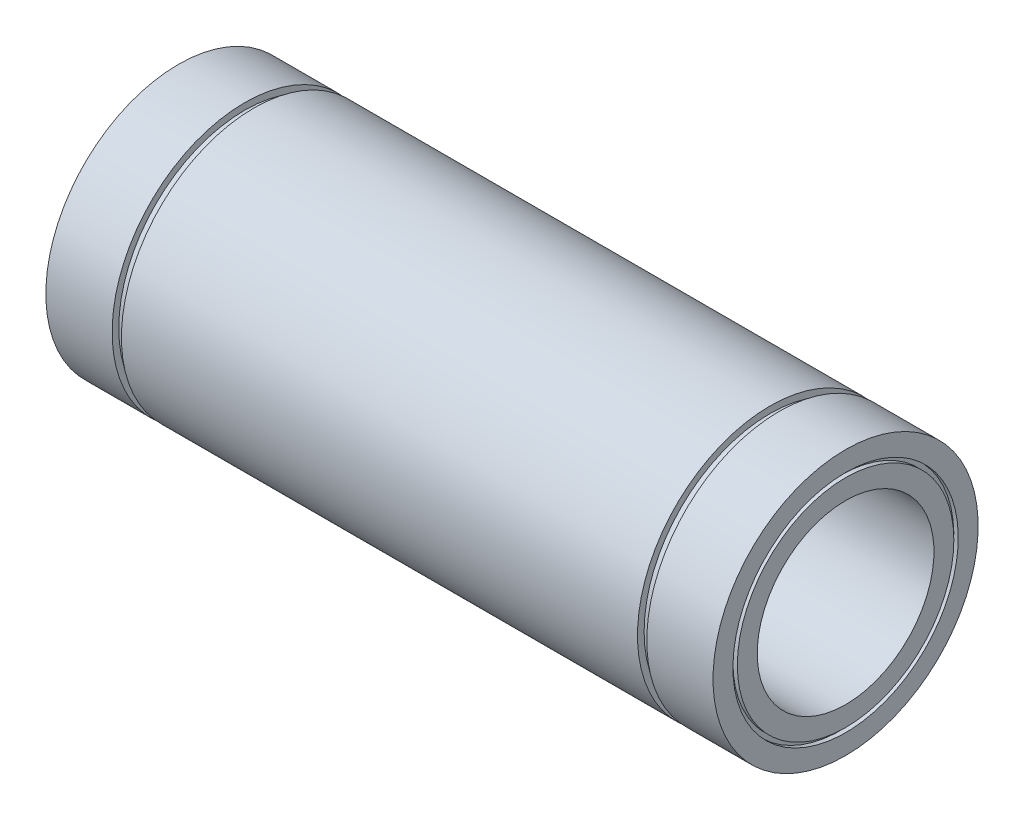
ISO-10303-21;
HEADER;
FILE_DESCRIPTION(('STEP AP214'),'2;1');
FILE_NAME('part.step','',(''),(''),'','','');
FILE_SCHEMA(('AUTOMOTIVE_DESIGN { 1 0 10303 214 1 1 1 1 }'));
ENDSEC;
DATA;
#1=APPLICATION_CONTEXT('core data for automotive mechanical design processes');
#2=APPLICATION_PROTOCOL_DEFINITION('international standard','automotive_design',2000,#1);
#3=PRODUCT_CONTEXT('',#1,'mechanical');
#4=PRODUCT('Part','Part','',(#3));
#5=PRODUCT_RELATED_PRODUCT_CATEGORY('part','',(#4));
#6=PRODUCT_DEFINITION_FORMATION('','',#4);
#7=PRODUCT_DEFINITION_CONTEXT('part definition',#1,'design');
#8=PRODUCT_DEFINITION('design','',#6,#7);
#9=PRODUCT_DEFINITION_SHAPE('','',#8);
#10=(LENGTH_UNIT() NAMED_UNIT(*) SI_UNIT(.MILLI.,.METRE.));
#11=(NAMED_UNIT(*) PLANE_ANGLE_UNIT() SI_UNIT($,.RADIAN.));
#12=(NAMED_UNIT(*) SI_UNIT($,.STERADIAN.) SOLID_ANGLE_UNIT());
#13=UNCERTAINTY_MEASURE_WITH_UNIT(LENGTH_MEASURE(1.E-05),#10,'distance_accuracy_value','');
#14=(GEOMETRIC_REPRESENTATION_CONTEXT(3) GLOBAL_UNCERTAINTY_ASSIGNED_CONTEXT((#13)) GLOBAL_UNIT_ASSIGNED_CONTEXT((#10,
#11,#12)) REPRESENTATION_CONTEXT('',''));
#15=CARTESIAN_POINT('',(0.,0.,0.));
#16=DIRECTION('',(0.,0.,1.));
#17=DIRECTION('',(1.,0.,0.));
#18=AXIS2_PLACEMENT_3D('',#15,#16,#17);
#19=CARTESIAN_POINT('',(-75.5,25.4999999999999,0.));
#20=DIRECTION('',(-1.,0.,0.));
#21=DIRECTION('',(0.,-1.,0.));
#22=AXIS2_PLACEMENT_3D('',#19,#20,#21);
#23=PLANE('',#22);
#24=CARTESIAN_POINT('',(-75.5,0.,0.));
#25=DIRECTION('',(1.,0.,0.));
#26=DIRECTION('',(0.,1.,0.));
#27=AXIS2_PLACEMENT_3D('',#24,#25,#26);
#28=CIRCLE('',#27,25.5);
#29=CARTESIAN_POINT('',(-75.5,25.4999999999999,0.));
#30=VERTEX_POINT('',#29);
#31=EDGE_CURVE('E123',#30,#30,#28,.T.);
#32=ORIENTED_EDGE('',*,*,#31,.T.);
#33=EDGE_LOOP('',(#32));
#34=FACE_BOUND('',#33,.T.);
#35=CARTESIAN_POINT('',(-75.5,0.,0.));
#36=DIRECTION('',(1.,0.,0.));
#37=DIRECTION('',(0.,1.,0.));
#38=AXIS2_PLACEMENT_3D('',#35,#36,#37);
#39=CIRCLE('',#38,30.);
#40=CARTESIAN_POINT('',(-75.5,29.9999999999999,0.));
#41=VERTEX_POINT('',#40);
#42=EDGE_CURVE('E10',#41,#41,#39,.T.);
#43=ORIENTED_EDGE('',*,*,#42,.F.);
#44=EDGE_LOOP('',(#43));
#45=FACE_BOUND('',#44,.T.);
#46=ADVANCED_FACE('F40',(#34,#45),#23,.T.);
#47=CARTESIAN_POINT('',(0.,0.,0.));
#48=DIRECTION('',(1.,0.,0.));
#49=DIRECTION('',(0.,1.,0.));
#50=AXIS2_PLACEMENT_3D('',#47,#48,#49);
#51=CYLINDRICAL_SURFACE('',#50,30.);
#52=ORIENTED_EDGE('',*,*,#42,.T.);
#53=EDGE_LOOP('',(#52));
#54=FACE_BOUND('',#53,.T.);
#55=CARTESIAN_POINT('',(-60.5,0.,0.));
#56=DIRECTION('',(1.,0.,0.));
#57=DIRECTION('',(0.,1.,0.));
#58=AXIS2_PLACEMENT_3D('',#55,#56,#57);
#59=CIRCLE('',#58,30.);
#60=CARTESIAN_POINT('',(-60.5,29.9999999999999,0.));
#61=VERTEX_POINT('',#60);
#62=EDGE_CURVE('E47',#61,#61,#59,.T.);
#63=ORIENTED_EDGE('',*,*,#62,.F.);
#64=EDGE_LOOP('',(#63));
#65=FACE_BOUND('',#64,.T.);
#66=ADVANCED_FACE('F142',(#54,#65),#51,.T.);
#67=CARTESIAN_POINT('',(-60.5,29.9999999999999,0.));
#68=DIRECTION('',(1.,0.,0.));
#69=DIRECTION('',(0.,1.,0.));
#70=AXIS2_PLACEMENT_3D('',#67,#68,#69);
#71=PLANE('',#70);
#72=ORIENTED_EDGE('',*,*,#62,.T.);
#73=EDGE_LOOP('',(#72));
#74=FACE_BOUND('',#73,.T.);
#75=CARTESIAN_POINT('',(-60.5,0.,0.));
#76=DIRECTION('',(1.,0.,0.));
#77=DIRECTION('',(0.,1.,0.));
#78=AXIS2_PLACEMENT_3D('',#75,#76,#77);
#79=CIRCLE('',#78,28.5);
#80=CARTESIAN_POINT('',(-60.5,28.5,0.));
#81=VERTEX_POINT('',#80);
#82=EDGE_CURVE('E54',#81,#81,#79,.T.);
#83=ORIENTED_EDGE('',*,*,#82,.F.);
#84=EDGE_LOOP('',(#83));
#85=FACE_BOUND('',#84,.T.);
#86=ADVANCED_FACE('F146',(#74,#85),#71,.T.);
#87=CARTESIAN_POINT('',(0.,0.,0.));
#88=DIRECTION('',(1.,0.,0.));
#89=DIRECTION('',(0.,1.,0.));
#90=AXIS2_PLACEMENT_3D('',#87,#88,#89);
#91=CYLINDRICAL_SURFACE('',#90,28.5);
#92=ORIENTED_EDGE('',*,*,#82,.T.);
#93=EDGE_LOOP('',(#92));
#94=FACE_BOUND('',#93,.T.);
#95=CARTESIAN_POINT('',(-58.4,0.,0.));
#96=DIRECTION('',(1.,0.,0.));
#97=DIRECTION('',(0.,1.,0.));
#98=AXIS2_PLACEMENT_3D('',#95,#96,#97);
#99=CIRCLE('',#98,28.5);
#100=CARTESIAN_POINT('',(-58.4,28.5,0.));
#101=VERTEX_POINT('',#100);
#102=EDGE_CURVE('E61',#101,#101,#99,.T.);
#103=ORIENTED_EDGE('',*,*,#102,.F.);
#104=EDGE_LOOP('',(#103));
#105=FACE_BOUND('',#104,.T.);
#106=ADVANCED_FACE('F150',(#94,#105),#91,.T.);
#107=CARTESIAN_POINT('',(-58.4,28.5,0.));
#108=DIRECTION('',(-1.,0.,0.));
#109=DIRECTION('',(0.,-1.,0.));
#110=AXIS2_PLACEMENT_3D('',#107,#108,#109);
#111=PLANE('',#110);
#112=ORIENTED_EDGE('',*,*,#102,.T.);
#113=EDGE_LOOP('',(#112));
#114=FACE_BOUND('',#113,.T.);
#115=CARTESIAN_POINT('',(-58.4,0.,0.));
#116=DIRECTION('',(1.,0.,0.));
#117=DIRECTION('',(0.,1.,0.));
#118=AXIS2_PLACEMENT_3D('',#115,#116,#117);
#119=CIRCLE('',#118,30.);
#120=CARTESIAN_POINT('',(-58.4,29.9999999999999,0.));
#121=VERTEX_POINT('',#120);
#122=EDGE_CURVE('E67',#121,#121,#119,.T.);
#123=ORIENTED_EDGE('',*,*,#122,.F.);
#124=EDGE_LOOP('',(#123));
#125=FACE_BOUND('',#124,.T.);
#126=ADVANCED_FACE('F156',(#114,#125),#111,.T.);
#127=CARTESIAN_POINT('',(0.,0.,0.));
#128=DIRECTION('',(1.,0.,0.));
#129=DIRECTION('',(0.,1.,0.));
#130=AXIS2_PLACEMENT_3D('',#127,#128,#129);
#131=CYLINDRICAL_SURFACE('',#130,30.);
#132=ORIENTED_EDGE('',*,*,#122,.T.);
#133=EDGE_LOOP('',(#132));
#134=FACE_BOUND('',#133,.T.);
#135=CARTESIAN_POINT('',(58.4,0.,0.));
#136=DIRECTION('',(1.,0.,0.));
#137=DIRECTION('',(0.,1.,0.));
#138=AXIS2_PLACEMENT_3D('',#135,#136,#137);
#139=CIRCLE('',#138,30.);
#140=CARTESIAN_POINT('',(58.4,30.,0.));
#141=VERTEX_POINT('',#140);
#142=EDGE_CURVE('E70',#141,#141,#139,.T.);
#143=ORIENTED_EDGE('',*,*,#142,.F.);
#144=EDGE_LOOP('',(#143));
#145=FACE_BOUND('',#144,.T.);
#146=ADVANCED_FACE('F160',(#134,#145),#131,.T.);
#147=CARTESIAN_POINT('',(58.4,30.,0.));
#148=DIRECTION('',(1.,0.,0.));
#149=DIRECTION('',(0.,1.,0.));
#150=AXIS2_PLACEMENT_3D('',#147,#148,#149);
#151=PLANE('',#150);
#152=ORIENTED_EDGE('',*,*,#142,.T.);
#153=EDGE_LOOP('',(#152));
#154=FACE_BOUND('',#153,.T.);
#155=CARTESIAN_POINT('',(58.4,0.,0.));
#156=DIRECTION('',(1.,0.,0.));
#157=DIRECTION('',(0.,1.,0.));
#158=AXIS2_PLACEMENT_3D('',#155,#156,#157);
#159=CIRCLE('',#158,28.5);
#160=CARTESIAN_POINT('',(58.4,28.5,0.));
#161=VERTEX_POINT('',#160);
#162=EDGE_CURVE('E74',#161,#161,#159,.T.);
#163=ORIENTED_EDGE('',*,*,#162,.F.);
#164=EDGE_LOOP('',(#163));
#165=FACE_BOUND('',#164,.T.);
#166=ADVANCED_FACE('F164',(#154,#165),#151,.T.);
#167=CARTESIAN_POINT('',(0.,0.,0.));
#168=DIRECTION('',(1.,0.,0.));
#169=DIRECTION('',(0.,1.,0.));
#170=AXIS2_PLACEMENT_3D('',#167,#168,#169);
#171=CYLINDRICAL_SURFACE('',#170,28.5);
#172=ORIENTED_EDGE('',*,*,#162,.T.);
#173=EDGE_LOOP('',(#172));
#174=FACE_BOUND('',#173,.T.);
#175=CARTESIAN_POINT('',(60.5,0.,0.));
#176=DIRECTION('',(1.,0.,0.));
#177=DIRECTION('',(0.,1.,0.));
#178=AXIS2_PLACEMENT_3D('',#175,#176,#177);
#179=CIRCLE('',#178,28.5);
#180=CARTESIAN_POINT('',(60.5,28.5,0.));
#181=VERTEX_POINT('',#180);
#182=EDGE_CURVE('E78',#181,#181,#179,.T.);
#183=ORIENTED_EDGE('',*,*,#182,.F.);
#184=EDGE_LOOP('',(#183));
#185=FACE_BOUND('',#184,.T.);
#186=ADVANCED_FACE('F168',(#174,#185),#171,.T.);
#187=CARTESIAN_POINT('',(60.5,28.5,0.));
#188=DIRECTION('',(-1.,0.,0.));
#189=DIRECTION('',(0.,-1.,0.));
#190=AXIS2_PLACEMENT_3D('',#187,#188,#189);
#191=PLANE('',#190);
#192=ORIENTED_EDGE('',*,*,#182,.T.);
#193=EDGE_LOOP('',(#192));
#194=FACE_BOUND('',#193,.T.);
#195=CARTESIAN_POINT('',(60.5,0.,0.));
#196=DIRECTION('',(1.,0.,0.));
#197=DIRECTION('',(0.,1.,0.));
#198=AXIS2_PLACEMENT_3D('',#195,#196,#197);
#199=CIRCLE('',#198,30.);
#200=CARTESIAN_POINT('',(60.5,30.,0.));
#201=VERTEX_POINT('',#200);
#202=EDGE_CURVE('E81',#201,#201,#199,.T.);
#203=ORIENTED_EDGE('',*,*,#202,.F.);
#204=EDGE_LOOP('',(#203));
#205=FACE_BOUND('',#204,.T.);
#206=ADVANCED_FACE('F172',(#194,#205),#191,.T.);
#207=CARTESIAN_POINT('',(0.,0.,0.));
#208=DIRECTION('',(1.,0.,0.));
#209=DIRECTION('',(0.,1.,0.));
#210=AXIS2_PLACEMENT_3D('',#207,#208,#209);
#211=CYLINDRICAL_SURFACE('',#210,29.9999999999999);
#212=ORIENTED_EDGE('',*,*,#202,.T.);
#213=EDGE_LOOP('',(#212));
#214=FACE_BOUND('',#213,.T.);
#215=CARTESIAN_POINT('',(75.4999999999999,0.,0.));
#216=DIRECTION('',(1.,0.,0.));
#217=DIRECTION('',(0.,1.,0.));
#218=AXIS2_PLACEMENT_3D('',#215,#216,#217);
#219=CIRCLE('',#218,29.9999999999999);
#220=CARTESIAN_POINT('',(75.4999999999999,29.9999999999999,0.));
#221=VERTEX_POINT('',#220);
#222=EDGE_CURVE('E84',#221,#221,#219,.T.);
#223=ORIENTED_EDGE('',*,*,#222,.F.);
#224=EDGE_LOOP('',(#223));
#225=FACE_BOUND('',#224,.T.);
#226=ADVANCED_FACE('F176',(#214,#225),#211,.T.);
#227=CARTESIAN_POINT('',(75.5,29.9999999999999,0.));
#228=DIRECTION('',(1.,0.,0.));
#229=DIRECTION('',(0.,1.,0.));
#230=AXIS2_PLACEMENT_3D('',#227,#228,#229);
#231=PLANE('',#230);
#232=ORIENTED_EDGE('',*,*,#222,.T.);
#233=EDGE_LOOP('',(#232));
#234=FACE_BOUND('',#233,.T.);
#235=CARTESIAN_POINT('',(75.5,0.,0.));
#236=DIRECTION('',(1.,0.,0.));
#237=DIRECTION('',(0.,1.,0.));
#238=AXIS2_PLACEMENT_3D('',#235,#236,#237);
#239=CIRCLE('',#238,25.4999999999999);
#240=CARTESIAN_POINT('',(75.5,25.4999999999999,0.));
#241=VERTEX_POINT('',#240);
#242=EDGE_CURVE('E88',#241,#241,#239,.T.);
#243=ORIENTED_EDGE('',*,*,#242,.F.);
#244=EDGE_LOOP('',(#243));
#245=FACE_BOUND('',#244,.T.);
#246=ADVANCED_FACE('F180',(#234,#245),#231,.T.);
#247=CARTESIAN_POINT('',(0.,0.,0.));
#248=DIRECTION('',(1.,0.,0.));
#249=DIRECTION('',(0.,1.,0.));
#250=AXIS2_PLACEMENT_3D('',#247,#248,#249);
#251=CYLINDRICAL_SURFACE('',#250,25.4999999999999);
#252=ORIENTED_EDGE('',*,*,#242,.T.);
#253=EDGE_LOOP('',(#252));
#254=FACE_BOUND('',#253,.T.);
#255=CARTESIAN_POINT('',(74.5,0.,0.));
#256=DIRECTION('',(1.,0.,0.));
#257=DIRECTION('',(0.,1.,0.));
#258=AXIS2_PLACEMENT_3D('',#255,#256,#257);
#259=CIRCLE('',#258,25.4999999999999);
#260=CARTESIAN_POINT('',(74.5,25.4999999999999,0.));
#261=VERTEX_POINT('',#260);
#262=EDGE_CURVE('E92',#261,#261,#259,.T.);
#263=ORIENTED_EDGE('',*,*,#262,.F.);
#264=EDGE_LOOP('',(#263));
#265=FACE_BOUND('',#264,.T.);
#266=ADVANCED_FACE('F184',(#254,#265),#251,.F.);
#267=CARTESIAN_POINT('',(74.5,25.4999999999999,0.));
#268=DIRECTION('',(1.,0.,0.));
#269=DIRECTION('',(0.,1.,0.));
#270=AXIS2_PLACEMENT_3D('',#267,#268,#269);
#271=PLANE('',#270);
#272=ORIENTED_EDGE('',*,*,#262,.T.);
#273=EDGE_LOOP('',(#272));
#274=FACE_BOUND('',#273,.T.);
#275=CARTESIAN_POINT('',(74.5,0.,0.));
#276=DIRECTION('',(1.,0.,0.));
#277=DIRECTION('',(0.,1.,0.));
#278=AXIS2_PLACEMENT_3D('',#275,#276,#277);
#279=CIRCLE('',#278,24.4999999999999);
#280=CARTESIAN_POINT('',(74.5,24.4999999999999,0.));
#281=VERTEX_POINT('',#280);
#282=EDGE_CURVE('E96',#281,#281,#279,.T.);
#283=ORIENTED_EDGE('',*,*,#282,.F.);
#284=EDGE_LOOP('',(#283));
#285=FACE_BOUND('',#284,.T.);
#286=ADVANCED_FACE('F188',(#274,#285),#271,.T.);
#287=CARTESIAN_POINT('',(0.,0.,0.));
#288=DIRECTION('',(1.,0.,0.));
#289=DIRECTION('',(0.,1.,0.));
#290=AXIS2_PLACEMENT_3D('',#287,#288,#289);
#291=CYLINDRICAL_SURFACE('',#290,24.4999999999999);
#292=ORIENTED_EDGE('',*,*,#282,.T.);
#293=EDGE_LOOP('',(#292));
#294=FACE_BOUND('',#293,.T.);
#295=CARTESIAN_POINT('',(75.5,0.,0.));
#296=DIRECTION('',(1.,0.,0.));
#297=DIRECTION('',(0.,1.,0.));
#298=AXIS2_PLACEMENT_3D('',#295,#296,#297);
#299=CIRCLE('',#298,24.4999999999999);
#300=CARTESIAN_POINT('',(75.5,24.4999999999999,0.));
#301=VERTEX_POINT('',#300);
#302=EDGE_CURVE('E100',#301,#301,#299,.T.);
#303=ORIENTED_EDGE('',*,*,#302,.F.);
#304=EDGE_LOOP('',(#303));
#305=FACE_BOUND('',#304,.T.);
#306=ADVANCED_FACE('F192',(#294,#305),#291,.T.);
#307=CARTESIAN_POINT('',(75.5,24.4999999999999,0.));
#308=DIRECTION('',(1.,0.,0.));
#309=DIRECTION('',(0.,1.,0.));
#310=AXIS2_PLACEMENT_3D('',#307,#308,#309);
#311=PLANE('',#310);
#312=ORIENTED_EDGE('',*,*,#302,.T.);
#313=EDGE_LOOP('',(#312));
#314=FACE_BOUND('',#313,.T.);
#315=CARTESIAN_POINT('',(75.4999999999999,0.,0.));
#316=DIRECTION('',(1.,0.,0.));
#317=DIRECTION('',(0.,1.,0.));
#318=AXIS2_PLACEMENT_3D('',#315,#316,#317);
#319=CIRCLE('',#318,19.9999999999999);
#320=CARTESIAN_POINT('',(75.4999999999999,19.9999999999999,0.));
#321=VERTEX_POINT('',#320);
#322=EDGE_CURVE('E103',#321,#321,#319,.T.);
#323=ORIENTED_EDGE('',*,*,#322,.F.);
#324=EDGE_LOOP('',(#323));
#325=FACE_BOUND('',#324,.T.);
#326=ADVANCED_FACE('F196',(#314,#325),#311,.T.);
#327=CARTESIAN_POINT('',(0.,0.,0.));
#328=DIRECTION('',(1.,0.,0.));
#329=DIRECTION('',(0.,1.,0.));
#330=AXIS2_PLACEMENT_3D('',#327,#328,#329);
#331=CYLINDRICAL_SURFACE('',#330,19.9999999999999);
#332=ORIENTED_EDGE('',*,*,#322,.T.);
#333=EDGE_LOOP('',(#332));
#334=FACE_BOUND('',#333,.T.);
#335=CARTESIAN_POINT('',(-75.5000000000001,0.,0.));
#336=DIRECTION('',(1.,0.,0.));
#337=DIRECTION('',(0.,1.,0.));
#338=AXIS2_PLACEMENT_3D('',#335,#336,#337);
#339=CIRCLE('',#338,20.);
#340=CARTESIAN_POINT('',(-75.5000000000001,19.9999999999999,0.));
#341=VERTEX_POINT('',#340);
#342=EDGE_CURVE('E107',#341,#341,#339,.T.);
#343=ORIENTED_EDGE('',*,*,#342,.F.);
#344=EDGE_LOOP('',(#343));
#345=FACE_BOUND('',#344,.T.);
#346=ADVANCED_FACE('F200',(#334,#345),#331,.F.);
#347=CARTESIAN_POINT('',(-75.5000000000001,19.9999999999999,0.));
#348=DIRECTION('',(-1.,0.,0.));
#349=DIRECTION('',(0.,-1.,0.));
#350=AXIS2_PLACEMENT_3D('',#347,#348,#349);
#351=PLANE('',#350);
#352=ORIENTED_EDGE('',*,*,#342,.T.);
#353=EDGE_LOOP('',(#352));
#354=FACE_BOUND('',#353,.T.);
#355=CARTESIAN_POINT('',(-75.5,0.,0.));
#356=DIRECTION('',(1.,0.,0.));
#357=DIRECTION('',(0.,1.,0.));
#358=AXIS2_PLACEMENT_3D('',#355,#356,#357);
#359=CIRCLE('',#358,24.5);
#360=CARTESIAN_POINT('',(-75.5,24.4999999999999,0.));
#361=VERTEX_POINT('',#360);
#362=EDGE_CURVE('E111',#361,#361,#359,.T.);
#363=ORIENTED_EDGE('',*,*,#362,.F.);
#364=EDGE_LOOP('',(#363));
#365=FACE_BOUND('',#364,.T.);
#366=ADVANCED_FACE('F204',(#354,#365),#351,.T.);
#367=CARTESIAN_POINT('',(0.,0.,0.));
#368=DIRECTION('',(1.,0.,0.));
#369=DIRECTION('',(0.,1.,0.));
#370=AXIS2_PLACEMENT_3D('',#367,#368,#369);
#371=CYLINDRICAL_SURFACE('',#370,24.5);
#372=ORIENTED_EDGE('',*,*,#362,.T.);
#373=EDGE_LOOP('',(#372));
#374=FACE_BOUND('',#373,.T.);
#375=CARTESIAN_POINT('',(-74.5,0.,0.));
#376=DIRECTION('',(1.,0.,0.));
#377=DIRECTION('',(0.,1.,0.));
#378=AXIS2_PLACEMENT_3D('',#375,#376,#377);
#379=CIRCLE('',#378,24.5);
#380=CARTESIAN_POINT('',(-74.5,24.4999999999999,0.));
#381=VERTEX_POINT('',#380);
#382=EDGE_CURVE('E115',#381,#381,#379,.T.);
#383=ORIENTED_EDGE('',*,*,#382,.F.);
#384=EDGE_LOOP('',(#383));
#385=FACE_BOUND('',#384,.T.);
#386=ADVANCED_FACE('F138',(#374,#385),#371,.T.);
#387=CARTESIAN_POINT('',(-74.5,25.4999999999999,0.));
#388=DIRECTION('',(-1.,0.,0.));
#389=DIRECTION('',(0.,-1.,0.));
#390=AXIS2_PLACEMENT_3D('',#387,#388,#389);
#391=PLANE('',#390);
#392=ORIENTED_EDGE('',*,*,#382,.T.);
#393=EDGE_LOOP('',(#392));
#394=FACE_BOUND('',#393,.T.);
#395=CARTESIAN_POINT('',(-74.5,0.,0.));
#396=DIRECTION('',(1.,0.,0.));
#397=DIRECTION('',(0.,1.,0.));
#398=AXIS2_PLACEMENT_3D('',#395,#396,#397);
#399=CIRCLE('',#398,25.5);
#400=CARTESIAN_POINT('',(-74.5,25.4999999999999,0.));
#401=VERTEX_POINT('',#400);
#402=EDGE_CURVE('E119',#401,#401,#399,.T.);
#403=ORIENTED_EDGE('',*,*,#402,.F.);
#404=EDGE_LOOP('',(#403));
#405=FACE_BOUND('',#404,.T.);
#406=ADVANCED_FACE('F132',(#394,#405),#391,.T.);
#407=CARTESIAN_POINT('',(0.,0.,0.));
#408=DIRECTION('',(1.,0.,0.));
#409=DIRECTION('',(0.,1.,0.));
#410=AXIS2_PLACEMENT_3D('',#407,#408,#409);
#411=CYLINDRICAL_SURFACE('',#410,25.5);
#412=ORIENTED_EDGE('',*,*,#402,.T.);
#413=EDGE_LOOP('',(#412));
#414=FACE_BOUND('',#413,.T.);
#415=ORIENTED_EDGE('',*,*,#31,.F.);
#416=EDGE_LOOP('',(#415));
#417=FACE_BOUND('',#416,.T.);
#418=ADVANCED_FACE('F130',(#414,#417),#411,.F.);
#419=CLOSED_SHELL('',(#46,#66,#86,#106,#126,#146,#166,#186,#206,#226,#246,#266,#286,#306,#326,
#346,#366,#386,#406,#418));
#420=MANIFOLD_SOLID_BREP('B2',#419);
#421=ADVANCED_BREP_SHAPE_REPRESENTATION('',(#18,#420),#14);
#422=SHAPE_DEFINITION_REPRESENTATION(#9,#421);
ENDSEC;
END-ISO-10303-21;
